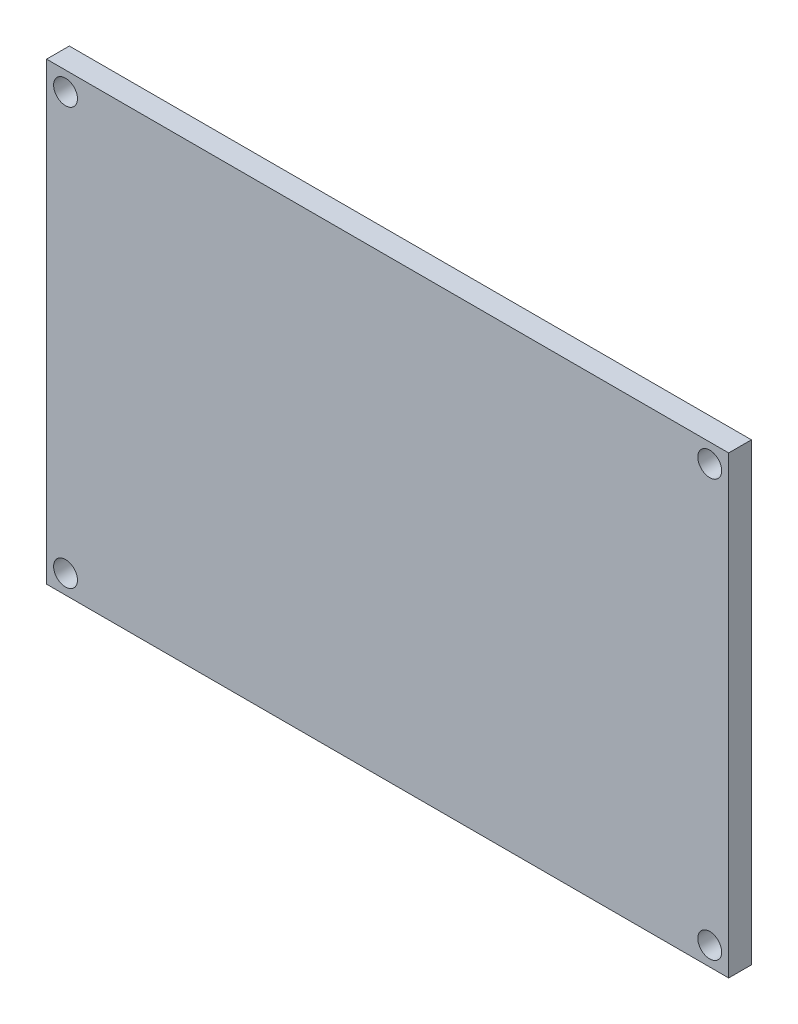
ISO-10303-21;
HEADER;
FILE_DESCRIPTION(('STEP AP214'),'2;1');
FILE_NAME('part.step','',(''),(''),'','','');
FILE_SCHEMA(('AUTOMOTIVE_DESIGN { 1 0 10303 214 1 1 1 1 }'));
ENDSEC;
DATA;
#1=APPLICATION_CONTEXT('core data for automotive mechanical design processes');
#2=APPLICATION_PROTOCOL_DEFINITION('international standard','automotive_design',2000,#1);
#3=PRODUCT_CONTEXT('',#1,'mechanical');
#4=PRODUCT('Part','Part','',(#3));
#5=PRODUCT_RELATED_PRODUCT_CATEGORY('part','',(#4));
#6=PRODUCT_DEFINITION_FORMATION('','',#4);
#7=PRODUCT_DEFINITION_CONTEXT('part definition',#1,'design');
#8=PRODUCT_DEFINITION('design','',#6,#7);
#9=PRODUCT_DEFINITION_SHAPE('','',#8);
#10=(LENGTH_UNIT() NAMED_UNIT(*) SI_UNIT(.MILLI.,.METRE.));
#11=(NAMED_UNIT(*) PLANE_ANGLE_UNIT() SI_UNIT($,.RADIAN.));
#12=(NAMED_UNIT(*) SI_UNIT($,.STERADIAN.) SOLID_ANGLE_UNIT());
#13=UNCERTAINTY_MEASURE_WITH_UNIT(LENGTH_MEASURE(1.E-05),#10,'distance_accuracy_value','');
#14=(GEOMETRIC_REPRESENTATION_CONTEXT(3) GLOBAL_UNCERTAINTY_ASSIGNED_CONTEXT((#13)) GLOBAL_UNIT_ASSIGNED_CONTEXT((#10,
#11,#12)) REPRESENTATION_CONTEXT('',''));
#15=CARTESIAN_POINT('',(0.,0.,0.));
#16=DIRECTION('',(0.,0.,1.));
#17=DIRECTION('',(1.,0.,0.));
#18=AXIS2_PLACEMENT_3D('',#15,#16,#17);
#19=CARTESIAN_POINT('',(0.,0.,3.));
#20=DIRECTION('',(0.,0.,1.));
#21=DIRECTION('',(1.,0.,0.));
#22=AXIS2_PLACEMENT_3D('',#19,#20,#21);
#23=PLANE('',#22);
#24=CARTESIAN_POINT('',(-42.5,-27.5,3.));
#25=DIRECTION('',(0.,0.,1.));
#26=DIRECTION('',(1.,0.,0.));
#27=AXIS2_PLACEMENT_3D('',#24,#25,#26);
#28=CIRCLE('',#27,1.575);
#29=CARTESIAN_POINT('',(-40.925,-27.5,3.));
#30=VERTEX_POINT('',#29);
#31=EDGE_CURVE('E121',#30,#30,#28,.T.);
#32=ORIENTED_EDGE('',*,*,#31,.F.);
#33=EDGE_LOOP('',(#32));
#34=FACE_BOUND('',#33,.T.);
#35=CARTESIAN_POINT('',(-42.5,27.5,3.));
#36=DIRECTION('',(0.,0.,1.));
#37=DIRECTION('',(1.,0.,0.));
#38=AXIS2_PLACEMENT_3D('',#35,#36,#37);
#39=CIRCLE('',#38,1.575);
#40=CARTESIAN_POINT('',(-40.925,27.5,3.));
#41=VERTEX_POINT('',#40);
#42=EDGE_CURVE('E100',#41,#41,#39,.T.);
#43=ORIENTED_EDGE('',*,*,#42,.F.);
#44=EDGE_LOOP('',(#43));
#45=FACE_BOUND('',#44,.T.);
#46=DIRECTION('',(0.,1.,0.));
#47=VECTOR('',#46,1.);
#48=CARTESIAN_POINT('',(45.,30.,3.));
#49=LINE('',#48,#47);
#50=CARTESIAN_POINT('',(45.,-30.,3.));
#51=VERTEX_POINT('',#50);
#52=CARTESIAN_POINT('',(45.,30.,3.));
#53=VERTEX_POINT('',#52);
#54=EDGE_CURVE('E85',#51,#53,#49,.T.);
#55=ORIENTED_EDGE('',*,*,#54,.T.);
#56=DIRECTION('',(-1.,0.,0.));
#57=VECTOR('',#56,1.);
#58=CARTESIAN_POINT('',(-45.,30.,3.));
#59=LINE('',#58,#57);
#60=CARTESIAN_POINT('',(-45.,30.,3.));
#61=VERTEX_POINT('',#60);
#62=EDGE_CURVE('E80',#53,#61,#59,.T.);
#63=ORIENTED_EDGE('',*,*,#62,.T.);
#64=DIRECTION('',(0.,-1.,0.));
#65=VECTOR('',#64,1.);
#66=CARTESIAN_POINT('',(-45.,30.,3.));
#67=LINE('',#66,#65);
#68=CARTESIAN_POINT('',(-45.,-30.,3.));
#69=VERTEX_POINT('',#68);
#70=EDGE_CURVE('E83',#61,#69,#67,.T.);
#71=ORIENTED_EDGE('',*,*,#70,.T.);
#72=DIRECTION('',(1.,0.,0.));
#73=VECTOR('',#72,1.);
#74=CARTESIAN_POINT('',(-45.,-30.,3.));
#75=LINE('',#74,#73);
#76=EDGE_CURVE('E50',#69,#51,#75,.T.);
#77=ORIENTED_EDGE('',*,*,#76,.T.);
#78=EDGE_LOOP('',(#55,#63,#71,#77));
#79=FACE_BOUND('',#78,.T.);
#80=CARTESIAN_POINT('',(42.5,27.5,3.));
#81=DIRECTION('',(0.,0.,1.));
#82=DIRECTION('',(1.,0.,0.));
#83=AXIS2_PLACEMENT_3D('',#80,#81,#82);
#84=CIRCLE('',#83,1.575);
#85=CARTESIAN_POINT('',(44.075,27.5,3.));
#86=VERTEX_POINT('',#85);
#87=EDGE_CURVE('E115',#86,#86,#84,.T.);
#88=ORIENTED_EDGE('',*,*,#87,.F.);
#89=EDGE_LOOP('',(#88));
#90=FACE_BOUND('',#89,.T.);
#91=CARTESIAN_POINT('',(42.5,-27.5,3.));
#92=DIRECTION('',(0.,0.,1.));
#93=DIRECTION('',(1.,0.,0.));
#94=AXIS2_PLACEMENT_3D('',#91,#92,#93);
#95=CIRCLE('',#94,1.575);
#96=CARTESIAN_POINT('',(44.075,-27.5,3.));
#97=VERTEX_POINT('',#96);
#98=EDGE_CURVE('E127',#97,#97,#95,.T.);
#99=ORIENTED_EDGE('',*,*,#98,.F.);
#100=EDGE_LOOP('',(#99));
#101=FACE_BOUND('',#100,.T.);
#102=ADVANCED_FACE('F33',(#34,#45,#79,#90,#101),#23,.T.);
#103=CARTESIAN_POINT('',(0.,0.,0.));
#104=DIRECTION('',(0.,0.,1.));
#105=DIRECTION('',(1.,0.,0.));
#106=AXIS2_PLACEMENT_3D('',#103,#104,#105);
#107=PLANE('',#106);
#108=DIRECTION('',(0.,1.,0.));
#109=VECTOR('',#108,1.);
#110=CARTESIAN_POINT('',(45.,30.,0.));
#111=LINE('',#110,#109);
#112=CARTESIAN_POINT('',(45.,-30.,0.));
#113=VERTEX_POINT('',#112);
#114=CARTESIAN_POINT('',(45.,30.,0.));
#115=VERTEX_POINT('',#114);
#116=EDGE_CURVE('E97',#113,#115,#111,.T.);
#117=ORIENTED_EDGE('',*,*,#116,.F.);
#118=DIRECTION('',(1.,0.,0.));
#119=VECTOR('',#118,1.);
#120=CARTESIAN_POINT('',(-45.,-30.,0.));
#121=LINE('',#120,#119);
#122=CARTESIAN_POINT('',(-45.,-30.,0.));
#123=VERTEX_POINT('',#122);
#124=EDGE_CURVE('E73',#123,#113,#121,.T.);
#125=ORIENTED_EDGE('',*,*,#124,.F.);
#126=DIRECTION('',(0.,-1.,0.));
#127=VECTOR('',#126,1.);
#128=CARTESIAN_POINT('',(-45.,30.,0.));
#129=LINE('',#128,#127);
#130=CARTESIAN_POINT('',(-45.,30.,0.));
#131=VERTEX_POINT('',#130);
#132=EDGE_CURVE('E67',#131,#123,#129,.T.);
#133=ORIENTED_EDGE('',*,*,#132,.F.);
#134=DIRECTION('',(-1.,0.,0.));
#135=VECTOR('',#134,1.);
#136=CARTESIAN_POINT('',(-45.,30.,0.));
#137=LINE('',#136,#135);
#138=EDGE_CURVE('E89',#115,#131,#137,.T.);
#139=ORIENTED_EDGE('',*,*,#138,.F.);
#140=EDGE_LOOP('',(#117,#125,#133,#139));
#141=FACE_BOUND('',#140,.T.);
#142=CARTESIAN_POINT('',(-42.5,27.5,0.));
#143=DIRECTION('',(0.,0.,1.));
#144=DIRECTION('',(1.,0.,0.));
#145=AXIS2_PLACEMENT_3D('',#142,#143,#144);
#146=CIRCLE('',#145,1.575);
#147=CARTESIAN_POINT('',(-40.925,27.5,0.));
#148=VERTEX_POINT('',#147);
#149=EDGE_CURVE('E112',#148,#148,#146,.T.);
#150=ORIENTED_EDGE('',*,*,#149,.T.);
#151=EDGE_LOOP('',(#150));
#152=FACE_BOUND('',#151,.T.);
#153=CARTESIAN_POINT('',(42.5,27.5,0.));
#154=DIRECTION('',(0.,0.,1.));
#155=DIRECTION('',(1.,0.,0.));
#156=AXIS2_PLACEMENT_3D('',#153,#154,#155);
#157=CIRCLE('',#156,1.575);
#158=CARTESIAN_POINT('',(44.075,27.5,0.));
#159=VERTEX_POINT('',#158);
#160=EDGE_CURVE('E118',#159,#159,#157,.T.);
#161=ORIENTED_EDGE('',*,*,#160,.T.);
#162=EDGE_LOOP('',(#161));
#163=FACE_BOUND('',#162,.T.);
#164=CARTESIAN_POINT('',(-42.5,-27.5,0.));
#165=DIRECTION('',(0.,0.,1.));
#166=DIRECTION('',(1.,0.,0.));
#167=AXIS2_PLACEMENT_3D('',#164,#165,#166);
#168=CIRCLE('',#167,1.575);
#169=CARTESIAN_POINT('',(-40.925,-27.5,0.));
#170=VERTEX_POINT('',#169);
#171=EDGE_CURVE('E124',#170,#170,#168,.T.);
#172=ORIENTED_EDGE('',*,*,#171,.T.);
#173=EDGE_LOOP('',(#172));
#174=FACE_BOUND('',#173,.T.);
#175=CARTESIAN_POINT('',(42.5,-27.5,0.));
#176=DIRECTION('',(0.,0.,1.));
#177=DIRECTION('',(1.,0.,0.));
#178=AXIS2_PLACEMENT_3D('',#175,#176,#177);
#179=CIRCLE('',#178,1.575);
#180=CARTESIAN_POINT('',(44.075,-27.5,0.));
#181=VERTEX_POINT('',#180);
#182=EDGE_CURVE('E130',#181,#181,#179,.T.);
#183=ORIENTED_EDGE('',*,*,#182,.T.);
#184=EDGE_LOOP('',(#183));
#185=FACE_BOUND('',#184,.T.);
#186=ADVANCED_FACE('F108',(#141,#152,#163,#174,#185),#107,.F.);
#187=CARTESIAN_POINT('',(45.,30.,3.));
#188=DIRECTION('',(-1.,0.,0.));
#189=DIRECTION('',(0.,-1.,0.));
#190=AXIS2_PLACEMENT_3D('',#187,#188,#189);
#191=PLANE('',#190);
#192=ORIENTED_EDGE('',*,*,#116,.T.);
#193=DIRECTION('',(0.,0.,-1.));
#194=VECTOR('',#193,1.);
#195=CARTESIAN_POINT('',(45.,30.,3.));
#196=LINE('',#195,#194);
#197=EDGE_CURVE('E11',#53,#115,#196,.T.);
#198=ORIENTED_EDGE('',*,*,#197,.F.);
#199=ORIENTED_EDGE('',*,*,#54,.F.);
#200=DIRECTION('',(0.,0.,-1.));
#201=VECTOR('',#200,1.);
#202=CARTESIAN_POINT('',(45.,-30.,3.));
#203=LINE('',#202,#201);
#204=EDGE_CURVE('E93',#51,#113,#203,.T.);
#205=ORIENTED_EDGE('',*,*,#204,.T.);
#206=EDGE_LOOP('',(#192,#198,#199,#205));
#207=FACE_BOUND('',#206,.T.);
#208=ADVANCED_FACE('F35',(#207),#191,.F.);
#209=CARTESIAN_POINT('',(-45.,30.,3.));
#210=DIRECTION('',(0.,-1.,0.));
#211=DIRECTION('',(0.,0.,-1.));
#212=AXIS2_PLACEMENT_3D('',#209,#210,#211);
#213=PLANE('',#212);
#214=ORIENTED_EDGE('',*,*,#138,.T.);
#215=DIRECTION('',(0.,0.,-1.));
#216=VECTOR('',#215,1.);
#217=CARTESIAN_POINT('',(-45.,30.,3.));
#218=LINE('',#217,#216);
#219=EDGE_CURVE('E42',#61,#131,#218,.T.);
#220=ORIENTED_EDGE('',*,*,#219,.F.);
#221=ORIENTED_EDGE('',*,*,#62,.F.);
#222=ORIENTED_EDGE('',*,*,#197,.T.);
#223=EDGE_LOOP('',(#214,#220,#221,#222));
#224=FACE_BOUND('',#223,.T.);
#225=ADVANCED_FACE('F88',(#224),#213,.F.);
#226=CARTESIAN_POINT('',(-45.,30.,3.));
#227=DIRECTION('',(1.,0.,0.));
#228=DIRECTION('',(0.,1.,0.));
#229=AXIS2_PLACEMENT_3D('',#226,#227,#228);
#230=PLANE('',#229);
#231=ORIENTED_EDGE('',*,*,#132,.T.);
#232=DIRECTION('',(0.,0.,-1.));
#233=VECTOR('',#232,1.);
#234=CARTESIAN_POINT('',(-45.,-30.,3.));
#235=LINE('',#234,#233);
#236=EDGE_CURVE('E90',#69,#123,#235,.T.);
#237=ORIENTED_EDGE('',*,*,#236,.F.);
#238=ORIENTED_EDGE('',*,*,#70,.F.);
#239=ORIENTED_EDGE('',*,*,#219,.T.);
#240=EDGE_LOOP('',(#231,#237,#238,#239));
#241=FACE_BOUND('',#240,.T.);
#242=ADVANCED_FACE('F91',(#241),#230,.F.);
#243=CARTESIAN_POINT('',(-45.,-30.,3.));
#244=DIRECTION('',(0.,1.,0.));
#245=DIRECTION('',(0.,0.,1.));
#246=AXIS2_PLACEMENT_3D('',#243,#244,#245);
#247=PLANE('',#246);
#248=ORIENTED_EDGE('',*,*,#124,.T.);
#249=ORIENTED_EDGE('',*,*,#204,.F.);
#250=ORIENTED_EDGE('',*,*,#76,.F.);
#251=ORIENTED_EDGE('',*,*,#236,.T.);
#252=EDGE_LOOP('',(#248,#249,#250,#251));
#253=FACE_BOUND('',#252,.T.);
#254=ADVANCED_FACE('F105',(#253),#247,.F.);
#255=CARTESIAN_POINT('',(-42.5,27.5,3.));
#256=DIRECTION('',(0.,0.,-1.));
#257=DIRECTION('',(-1.,0.,0.));
#258=AXIS2_PLACEMENT_3D('',#255,#256,#257);
#259=CYLINDRICAL_SURFACE('',#258,1.575);
#260=ORIENTED_EDGE('',*,*,#42,.T.);
#261=EDGE_LOOP('',(#260));
#262=FACE_BOUND('',#261,.T.);
#263=ORIENTED_EDGE('',*,*,#149,.F.);
#264=EDGE_LOOP('',(#263));
#265=FACE_BOUND('',#264,.T.);
#266=ADVANCED_FACE('F149',(#262,#265),#259,.F.);
#267=CARTESIAN_POINT('',(42.5,27.5,3.));
#268=DIRECTION('',(0.,0.,-1.));
#269=DIRECTION('',(-1.,0.,0.));
#270=AXIS2_PLACEMENT_3D('',#267,#268,#269);
#271=CYLINDRICAL_SURFACE('',#270,1.575);
#272=ORIENTED_EDGE('',*,*,#87,.T.);
#273=EDGE_LOOP('',(#272));
#274=FACE_BOUND('',#273,.T.);
#275=ORIENTED_EDGE('',*,*,#160,.F.);
#276=EDGE_LOOP('',(#275));
#277=FACE_BOUND('',#276,.T.);
#278=ADVANCED_FACE('F195',(#274,#277),#271,.F.);
#279=CARTESIAN_POINT('',(-42.5,-27.5,3.));
#280=DIRECTION('',(0.,0.,-1.));
#281=DIRECTION('',(-1.,0.,0.));
#282=AXIS2_PLACEMENT_3D('',#279,#280,#281);
#283=CYLINDRICAL_SURFACE('',#282,1.575);
#284=ORIENTED_EDGE('',*,*,#31,.T.);
#285=EDGE_LOOP('',(#284));
#286=FACE_BOUND('',#285,.T.);
#287=ORIENTED_EDGE('',*,*,#171,.F.);
#288=EDGE_LOOP('',(#287));
#289=FACE_BOUND('',#288,.T.);
#290=ADVANCED_FACE('F203',(#286,#289),#283,.F.);
#291=CARTESIAN_POINT('',(42.5,-27.5,3.));
#292=DIRECTION('',(0.,0.,-1.));
#293=DIRECTION('',(-1.,0.,0.));
#294=AXIS2_PLACEMENT_3D('',#291,#292,#293);
#295=CYLINDRICAL_SURFACE('',#294,1.575);
#296=ORIENTED_EDGE('',*,*,#98,.T.);
#297=EDGE_LOOP('',(#296));
#298=FACE_BOUND('',#297,.T.);
#299=ORIENTED_EDGE('',*,*,#182,.F.);
#300=EDGE_LOOP('',(#299));
#301=FACE_BOUND('',#300,.T.);
#302=ADVANCED_FACE('F136',(#298,#301),#295,.F.);
#303=CLOSED_SHELL('',(#102,#186,#208,#225,#242,#254,#266,#278,#290,#302));
#304=MANIFOLD_SOLID_BREP('B2',#303);
#305=ADVANCED_BREP_SHAPE_REPRESENTATION('',(#18,#304),#14);
#306=SHAPE_DEFINITION_REPRESENTATION(#9,#305);
ENDSEC;
END-ISO-10303-21;
